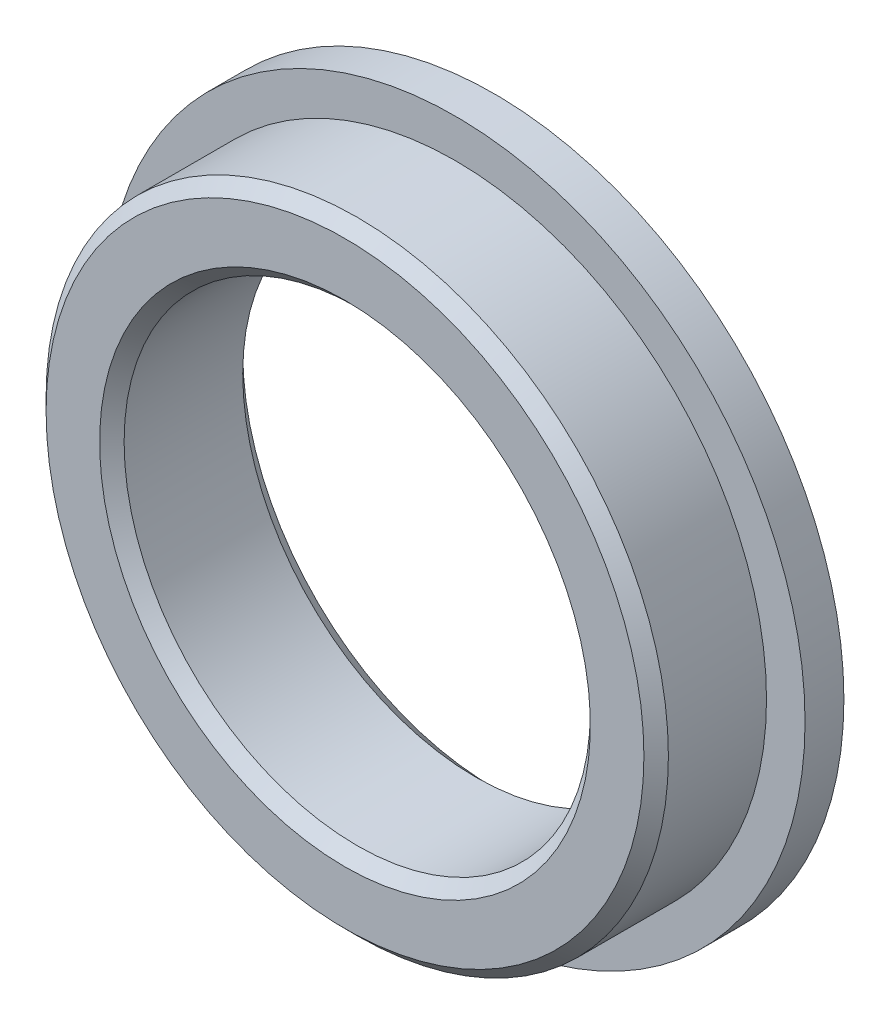
ISO-10303-21;
HEADER;
FILE_DESCRIPTION(('STEP AP214'),'2;1');
FILE_NAME('part.step','',(''),(''),'','','');
FILE_SCHEMA(('AUTOMOTIVE_DESIGN { 1 0 10303 214 1 1 1 1 }'));
ENDSEC;
DATA;
#1=APPLICATION_CONTEXT('core data for automotive mechanical design processes');
#2=APPLICATION_PROTOCOL_DEFINITION('international standard','automotive_design',2000,#1);
#3=PRODUCT_CONTEXT('',#1,'mechanical');
#4=PRODUCT('Part','Part','',(#3));
#5=PRODUCT_RELATED_PRODUCT_CATEGORY('part','',(#4));
#6=PRODUCT_DEFINITION_FORMATION('','',#4);
#7=PRODUCT_DEFINITION_CONTEXT('part definition',#1,'design');
#8=PRODUCT_DEFINITION('design','',#6,#7);
#9=PRODUCT_DEFINITION_SHAPE('','',#8);
#10=(LENGTH_UNIT() NAMED_UNIT(*) SI_UNIT(.MILLI.,.METRE.));
#11=(NAMED_UNIT(*) PLANE_ANGLE_UNIT() SI_UNIT($,.RADIAN.));
#12=(NAMED_UNIT(*) SI_UNIT($,.STERADIAN.) SOLID_ANGLE_UNIT());
#13=UNCERTAINTY_MEASURE_WITH_UNIT(LENGTH_MEASURE(1.E-05),#10,'distance_accuracy_value','');
#14=(GEOMETRIC_REPRESENTATION_CONTEXT(3) GLOBAL_UNCERTAINTY_ASSIGNED_CONTEXT((#13)) GLOBAL_UNIT_ASSIGNED_CONTEXT((#10,
#11,#12)) REPRESENTATION_CONTEXT('',''));
#15=CARTESIAN_POINT('',(0.,0.,0.));
#16=DIRECTION('',(0.,0.,1.));
#17=DIRECTION('',(1.,0.,0.));
#18=AXIS2_PLACEMENT_3D('',#15,#16,#17);
#19=CARTESIAN_POINT('',(0.,0.,2.54799999999978));
#20=DIRECTION('',(0.,0.,-1.));
#21=DIRECTION('',(-1.,0.,0.));
#22=AXIS2_PLACEMENT_3D('',#19,#20,#21);
#23=CONICAL_SURFACE('',#22,12.7126999999998,0.785398163396999);
#24=CARTESIAN_POINT('',(0.,0.,2.548));
#25=DIRECTION('',(0.,0.,1.));
#26=DIRECTION('',(1.,0.,0.));
#27=AXIS2_PLACEMENT_3D('',#24,#25,#26);
#28=CIRCLE('',#27,12.7127);
#29=CARTESIAN_POINT('',(12.7127,0.,2.548));
#30=VERTEX_POINT('',#29);
#31=EDGE_CURVE('E30',#30,#30,#28,.F.);
#32=ORIENTED_EDGE('',*,*,#31,.F.);
#33=EDGE_LOOP('',(#32));
#34=FACE_BOUND('',#33,.T.);
#35=CARTESIAN_POINT('',(0.,0.,3.048));
#36=DIRECTION('',(0.,0.,-1.));
#37=DIRECTION('',(-1.,0.,0.));
#38=AXIS2_PLACEMENT_3D('',#35,#36,#37);
#39=CIRCLE('',#38,12.2127);
#40=CARTESIAN_POINT('',(-12.2127,0.,3.048));
#41=VERTEX_POINT('',#40);
#42=EDGE_CURVE('E18',#41,#41,#39,.T.);
#43=ORIENTED_EDGE('',*,*,#42,.T.);
#44=EDGE_LOOP('',(#43));
#45=FACE_BOUND('',#44,.T.);
#46=ADVANCED_FACE('F15',(#34,#45),#23,.T.);
#47=CARTESIAN_POINT('',(0.,9.525,3.048));
#48=DIRECTION('',(0.,0.,-1.));
#49=DIRECTION('',(-1.,0.,0.));
#50=AXIS2_PLACEMENT_3D('',#47,#48,#49);
#51=PLANE('',#50);
#52=CARTESIAN_POINT('',(0.,0.,3.04800000000022));
#53=DIRECTION('',(0.,0.,1.));
#54=DIRECTION('',(0.,-1.,0.));
#55=AXIS2_PLACEMENT_3D('',#52,#53,#54);
#56=CIRCLE('',#55,10.0249999999998);
#57=CARTESIAN_POINT('',(0.,-10.0249999999998,3.04800000000022));
#58=VERTEX_POINT('',#57);
#59=EDGE_CURVE('E39',#58,#58,#56,.F.);
#60=ORIENTED_EDGE('',*,*,#59,.T.);
#61=EDGE_LOOP('',(#60));
#62=FACE_BOUND('',#61,.T.);
#63=ORIENTED_EDGE('',*,*,#42,.F.);
#64=EDGE_LOOP('',(#63));
#65=FACE_BOUND('',#64,.T.);
#66=ADVANCED_FACE('F50',(#62,#65),#51,.F.);
#67=CARTESIAN_POINT('',(0.,0.,4.09575));
#68=DIRECTION('',(0.,0.,1.));
#69=DIRECTION('',(1.,0.,0.));
#70=AXIS2_PLACEMENT_3D('',#67,#68,#69);
#71=CYLINDRICAL_SURFACE('',#70,12.7127);
#72=ORIENTED_EDGE('',*,*,#31,.T.);
#73=EDGE_LOOP('',(#72));
#74=FACE_BOUND('',#73,.T.);
#75=CARTESIAN_POINT('',(0.,0.,-1.46050000037));
#76=DIRECTION('',(0.,0.,1.));
#77=DIRECTION('',(1.,0.,0.));
#78=AXIS2_PLACEMENT_3D('',#75,#76,#77);
#79=CIRCLE('',#78,12.7127);
#80=CARTESIAN_POINT('',(12.7127,0.,-1.46050000037));
#81=VERTEX_POINT('',#80);
#82=EDGE_CURVE('E37',#81,#81,#79,.T.);
#83=ORIENTED_EDGE('',*,*,#82,.T.);
#84=EDGE_LOOP('',(#83));
#85=FACE_BOUND('',#84,.T.);
#86=ADVANCED_FACE('F52',(#74,#85),#71,.T.);
#87=CARTESIAN_POINT('',(0.,0.,3.04800000000022));
#88=DIRECTION('',(0.,0.,1.));
#89=DIRECTION('',(0.,-1.,0.));
#90=AXIS2_PLACEMENT_3D('',#87,#88,#89);
#91=CONICAL_SURFACE('',#90,10.0249999999998,0.785398163397);
#92=ORIENTED_EDGE('',*,*,#59,.F.);
#93=EDGE_LOOP('',(#92));
#94=FACE_BOUND('',#93,.T.);
#95=CARTESIAN_POINT('',(0.,0.,2.548));
#96=DIRECTION('',(0.,0.,1.));
#97=DIRECTION('',(1.,0.,0.));
#98=AXIS2_PLACEMENT_3D('',#95,#96,#97);
#99=CIRCLE('',#98,9.525);
#100=CARTESIAN_POINT('',(9.525,0.,2.548));
#101=VERTEX_POINT('',#100);
#102=EDGE_CURVE('E36',#101,#101,#99,.F.);
#103=ORIENTED_EDGE('',*,*,#102,.T.);
#104=EDGE_LOOP('',(#103));
#105=FACE_BOUND('',#104,.T.);
#106=ADVANCED_FACE('F58',(#94,#105),#91,.F.);
#107=CARTESIAN_POINT('',(0.,12.7127,-1.4605));
#108=DIRECTION('',(0.,0.,-1.));
#109=DIRECTION('',(-1.,0.,0.));
#110=AXIS2_PLACEMENT_3D('',#107,#108,#109);
#111=PLANE('',#110);
#112=ORIENTED_EDGE('',*,*,#82,.F.);
#113=EDGE_LOOP('',(#112));
#114=FACE_BOUND('',#113,.T.);
#115=CARTESIAN_POINT('',(0.,0.,-1.46050000037));
#116=DIRECTION('',(0.,0.,1.));
#117=DIRECTION('',(1.,0.,0.));
#118=AXIS2_PLACEMENT_3D('',#115,#116,#117);
#119=CIRCLE('',#118,14.2875);
#120=CARTESIAN_POINT('',(14.2875,0.,-1.46050000037));
#121=VERTEX_POINT('',#120);
#122=EDGE_CURVE('E33',#121,#121,#119,.F.);
#123=ORIENTED_EDGE('',*,*,#122,.F.);
#124=EDGE_LOOP('',(#123));
#125=FACE_BOUND('',#124,.T.);
#126=ADVANCED_FACE('F79',(#114,#125),#111,.F.);
#127=CARTESIAN_POINT('',(0.,0.,4.09575));
#128=DIRECTION('',(0.,0.,1.));
#129=DIRECTION('',(1.,0.,0.));
#130=AXIS2_PLACEMENT_3D('',#127,#128,#129);
#131=CYLINDRICAL_SURFACE('',#130,9.525);
#132=ORIENTED_EDGE('',*,*,#102,.F.);
#133=EDGE_LOOP('',(#132));
#134=FACE_BOUND('',#133,.T.);
#135=CARTESIAN_POINT('',(0.,0.,-2.29799999999966));
#136=DIRECTION('',(0.,0.,-1.));
#137=DIRECTION('',(1.,0.,0.));
#138=AXIS2_PLACEMENT_3D('',#135,#136,#137);
#139=CIRCLE('',#138,9.52500000000034);
#140=CARTESIAN_POINT('',(9.52500000000034,0.,-2.29799999999966));
#141=VERTEX_POINT('',#140);
#142=EDGE_CURVE('E27',#141,#141,#139,.T.);
#143=ORIENTED_EDGE('',*,*,#142,.T.);
#144=EDGE_LOOP('',(#143));
#145=FACE_BOUND('',#144,.T.);
#146=ADVANCED_FACE('F75',(#134,#145),#131,.F.);
#147=CARTESIAN_POINT('',(0.,0.,4.09575));
#148=DIRECTION('',(0.,0.,1.));
#149=DIRECTION('',(1.,0.,0.));
#150=AXIS2_PLACEMENT_3D('',#147,#148,#149);
#151=CYLINDRICAL_SURFACE('',#150,14.2875);
#152=ORIENTED_EDGE('',*,*,#122,.T.);
#153=EDGE_LOOP('',(#152));
#154=FACE_BOUND('',#153,.T.);
#155=CARTESIAN_POINT('',(0.,0.,-3.04800000075));
#156=DIRECTION('',(0.,0.,1.));
#157=DIRECTION('',(1.,0.,0.));
#158=AXIS2_PLACEMENT_3D('',#155,#156,#157);
#159=CIRCLE('',#158,14.2875);
#160=CARTESIAN_POINT('',(14.2875,0.,-3.04800000075));
#161=VERTEX_POINT('',#160);
#162=EDGE_CURVE('E22',#161,#161,#159,.T.);
#163=ORIENTED_EDGE('',*,*,#162,.T.);
#164=EDGE_LOOP('',(#163));
#165=FACE_BOUND('',#164,.T.);
#166=ADVANCED_FACE('F69',(#154,#165),#151,.T.);
#167=CARTESIAN_POINT('',(0.,0.,-3.048));
#168=DIRECTION('',(0.,0.,-1.));
#169=DIRECTION('',(-1.,0.,0.));
#170=AXIS2_PLACEMENT_3D('',#167,#168,#169);
#171=CONICAL_SURFACE('',#170,10.275,0.785398163397);
#172=CARTESIAN_POINT('',(0.,0.,-3.048));
#173=DIRECTION('',(0.,0.,-1.));
#174=DIRECTION('',(-1.,0.,0.));
#175=AXIS2_PLACEMENT_3D('',#172,#173,#174);
#176=CIRCLE('',#175,10.275);
#177=CARTESIAN_POINT('',(-10.275,0.,-3.048));
#178=VERTEX_POINT('',#177);
#179=EDGE_CURVE('E10',#178,#178,#176,.T.);
#180=ORIENTED_EDGE('',*,*,#179,.T.);
#181=EDGE_LOOP('',(#180));
#182=FACE_BOUND('',#181,.T.);
#183=ORIENTED_EDGE('',*,*,#142,.F.);
#184=EDGE_LOOP('',(#183));
#185=FACE_BOUND('',#184,.T.);
#186=ADVANCED_FACE('F63',(#182,#185),#171,.F.);
#187=CARTESIAN_POINT('',(0.,14.2875,-3.048));
#188=DIRECTION('',(0.,0.,1.));
#189=DIRECTION('',(1.,0.,0.));
#190=AXIS2_PLACEMENT_3D('',#187,#188,#189);
#191=PLANE('',#190);
#192=ORIENTED_EDGE('',*,*,#179,.F.);
#193=EDGE_LOOP('',(#192));
#194=FACE_BOUND('',#193,.T.);
#195=ORIENTED_EDGE('',*,*,#162,.F.);
#196=EDGE_LOOP('',(#195));
#197=FACE_BOUND('',#196,.T.);
#198=ADVANCED_FACE('F61',(#194,#197),#191,.F.);
#199=CLOSED_SHELL('',(#46,#66,#86,#106,#126,#146,#166,#186,#198));
#200=MANIFOLD_SOLID_BREP('B1',#199);
#201=ADVANCED_BREP_SHAPE_REPRESENTATION('',(#18,#200),#14);
#202=SHAPE_DEFINITION_REPRESENTATION(#9,#201);
ENDSEC;
END-ISO-10303-21;
